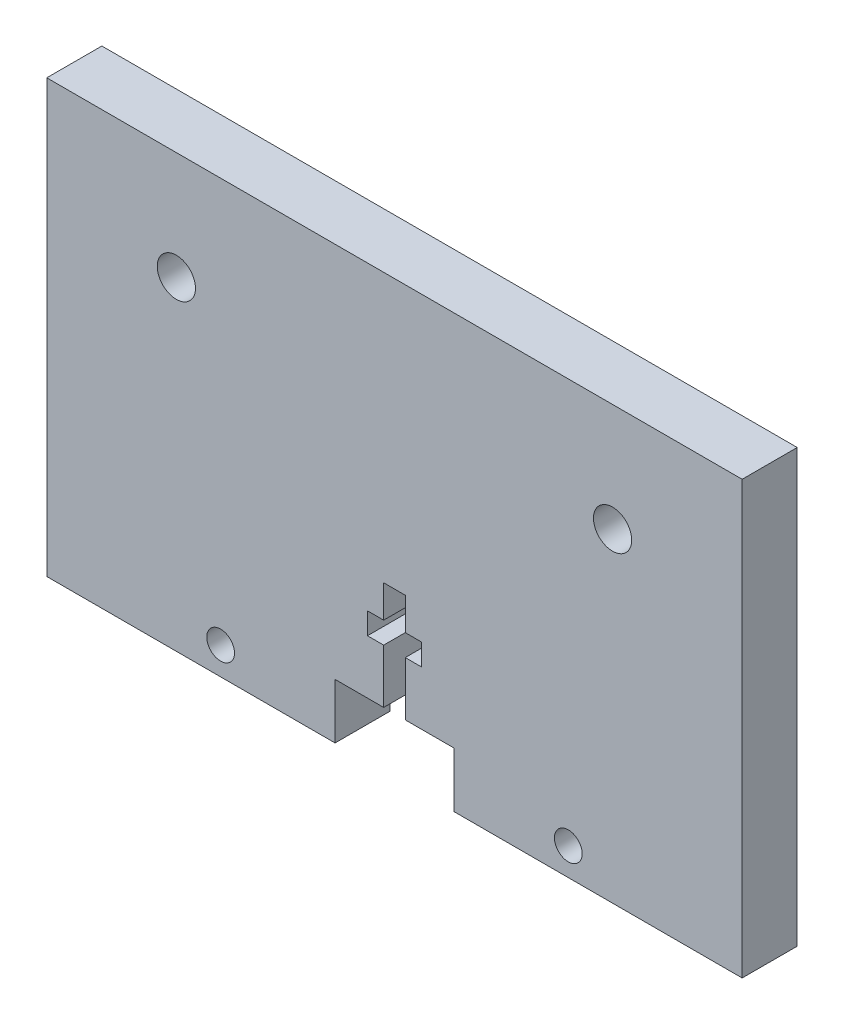
ISO-10303-21;
HEADER;
FILE_DESCRIPTION(('STEP AP214'),'2;1');
FILE_NAME('part.step','',(''),(''),'','','');
FILE_SCHEMA(('AUTOMOTIVE_DESIGN { 1 0 10303 214 1 1 1 1 }'));
ENDSEC;
DATA;
#1=APPLICATION_CONTEXT('core data for automotive mechanical design processes');
#2=APPLICATION_PROTOCOL_DEFINITION('international standard','automotive_design',2000,#1);
#3=PRODUCT_CONTEXT('',#1,'mechanical');
#4=PRODUCT('Part','Part','',(#3));
#5=PRODUCT_RELATED_PRODUCT_CATEGORY('part','',(#4));
#6=PRODUCT_DEFINITION_FORMATION('','',#4);
#7=PRODUCT_DEFINITION_CONTEXT('part definition',#1,'design');
#8=PRODUCT_DEFINITION('design','',#6,#7);
#9=PRODUCT_DEFINITION_SHAPE('','',#8);
#10=(LENGTH_UNIT() NAMED_UNIT(*) SI_UNIT(.MILLI.,.METRE.));
#11=(NAMED_UNIT(*) PLANE_ANGLE_UNIT() SI_UNIT($,.RADIAN.));
#12=(NAMED_UNIT(*) SI_UNIT($,.STERADIAN.) SOLID_ANGLE_UNIT());
#13=UNCERTAINTY_MEASURE_WITH_UNIT(LENGTH_MEASURE(1.E-05),#10,'distance_accuracy_value','');
#14=(GEOMETRIC_REPRESENTATION_CONTEXT(3) GLOBAL_UNCERTAINTY_ASSIGNED_CONTEXT((#13)) GLOBAL_UNIT_ASSIGNED_CONTEXT((#10,
#11,#12)) REPRESENTATION_CONTEXT('',''));
#15=CARTESIAN_POINT('',(0.,0.,0.));
#16=DIRECTION('',(0.,0.,1.));
#17=DIRECTION('',(1.,0.,0.));
#18=AXIS2_PLACEMENT_3D('',#15,#16,#17);
#19=CARTESIAN_POINT('',(3.175,0.,6.477));
#20=DIRECTION('',(-1.,0.,0.));
#21=DIRECTION('',(0.,-1.,0.));
#22=AXIS2_PLACEMENT_3D('',#19,#20,#21);
#23=PLANE('',#22);
#24=DIRECTION('',(0.,1.,0.));
#25=VECTOR('',#24,1.);
#26=CARTESIAN_POINT('',(3.175,0.,0.));
#27=LINE('',#26,#25);
#28=CARTESIAN_POINT('',(3.175,-12.573,0.));
#29=VERTEX_POINT('',#28);
#30=CARTESIAN_POINT('',(3.175,-10.033,0.));
#31=VERTEX_POINT('',#30);
#32=EDGE_CURVE('E242',#29,#31,#27,.T.);
#33=ORIENTED_EDGE('',*,*,#32,.F.);
#34=DIRECTION('',(0.,0.,-1.));
#35=VECTOR('',#34,1.);
#36=CARTESIAN_POINT('',(3.175,-12.573,6.477));
#37=LINE('',#36,#35);
#38=CARTESIAN_POINT('',(3.175,-12.573,6.477));
#39=VERTEX_POINT('',#38);
#40=EDGE_CURVE('E11',#39,#29,#37,.T.);
#41=ORIENTED_EDGE('',*,*,#40,.F.);
#42=DIRECTION('',(0.,1.,0.));
#43=VECTOR('',#42,1.);
#44=CARTESIAN_POINT('',(3.175,0.,6.477));
#45=LINE('',#44,#43);
#46=CARTESIAN_POINT('',(3.175,-10.033,6.477));
#47=VERTEX_POINT('',#46);
#48=EDGE_CURVE('E211',#39,#47,#45,.T.);
#49=ORIENTED_EDGE('',*,*,#48,.T.);
#50=DIRECTION('',(0.,0.,-1.));
#51=VECTOR('',#50,1.);
#52=CARTESIAN_POINT('',(3.175,-10.033,6.477));
#53=LINE('',#52,#51);
#54=EDGE_CURVE('E121',#47,#31,#53,.T.);
#55=ORIENTED_EDGE('',*,*,#54,.T.);
#56=EDGE_LOOP('',(#33,#41,#49,#55));
#57=FACE_BOUND('',#56,.T.);
#58=ADVANCED_FACE('F34',(#57),#23,.T.);
#59=CARTESIAN_POINT('',(0.,-12.573,6.477));
#60=DIRECTION('',(0.,1.,0.));
#61=DIRECTION('',(0.,0.,1.));
#62=AXIS2_PLACEMENT_3D('',#59,#60,#61);
#63=PLANE('',#62);
#64=DIRECTION('',(1.,0.,0.));
#65=VECTOR('',#64,1.);
#66=CARTESIAN_POINT('',(0.,-12.573,0.));
#67=LINE('',#66,#65);
#68=CARTESIAN_POINT('',(1.27,-12.573,0.));
#69=VERTEX_POINT('',#68);
#70=EDGE_CURVE('E245',#69,#29,#67,.T.);
#71=ORIENTED_EDGE('',*,*,#70,.F.);
#72=DIRECTION('',(0.,0.,-1.));
#73=VECTOR('',#72,1.);
#74=CARTESIAN_POINT('',(1.27,-12.573,6.477));
#75=LINE('',#74,#73);
#76=CARTESIAN_POINT('',(1.27,-12.573,6.477));
#77=VERTEX_POINT('',#76);
#78=EDGE_CURVE('E43',#77,#69,#75,.T.);
#79=ORIENTED_EDGE('',*,*,#78,.F.);
#80=DIRECTION('',(1.,0.,0.));
#81=VECTOR('',#80,1.);
#82=CARTESIAN_POINT('',(0.,-12.573,6.477));
#83=LINE('',#82,#81);
#84=EDGE_CURVE('E205',#77,#39,#83,.T.);
#85=ORIENTED_EDGE('',*,*,#84,.T.);
#86=ORIENTED_EDGE('',*,*,#40,.T.);
#87=EDGE_LOOP('',(#71,#79,#85,#86));
#88=FACE_BOUND('',#87,.T.);
#89=ADVANCED_FACE('F334',(#88),#63,.T.);
#90=CARTESIAN_POINT('',(1.27,0.,6.477));
#91=DIRECTION('',(-1.,0.,0.));
#92=DIRECTION('',(0.,-1.,0.));
#93=AXIS2_PLACEMENT_3D('',#90,#91,#92);
#94=PLANE('',#93);
#95=DIRECTION('',(0.,1.,0.));
#96=VECTOR('',#95,1.);
#97=CARTESIAN_POINT('',(1.27,0.,0.));
#98=LINE('',#97,#96);
#99=CARTESIAN_POINT('',(1.27,-18.923,0.));
#100=VERTEX_POINT('',#99);
#101=EDGE_CURVE('E248',#100,#69,#98,.T.);
#102=ORIENTED_EDGE('',*,*,#101,.F.);
#103=DIRECTION('',(0.,0.,-1.));
#104=VECTOR('',#103,1.);
#105=CARTESIAN_POINT('',(1.27,-18.923,6.477));
#106=LINE('',#105,#104);
#107=CARTESIAN_POINT('',(1.27,-18.923,6.477));
#108=VERTEX_POINT('',#107);
#109=EDGE_CURVE('E330',#108,#100,#106,.T.);
#110=ORIENTED_EDGE('',*,*,#109,.F.);
#111=DIRECTION('',(0.,1.,0.));
#112=VECTOR('',#111,1.);
#113=CARTESIAN_POINT('',(1.27,0.,6.477));
#114=LINE('',#113,#112);
#115=EDGE_CURVE('E197',#108,#77,#114,.T.);
#116=ORIENTED_EDGE('',*,*,#115,.T.);
#117=ORIENTED_EDGE('',*,*,#78,.T.);
#118=EDGE_LOOP('',(#102,#110,#116,#117));
#119=FACE_BOUND('',#118,.T.);
#120=ADVANCED_FACE('F333',(#119),#94,.T.);
#121=CARTESIAN_POINT('',(0.,-18.923,6.477));
#122=DIRECTION('',(0.,1.,0.));
#123=DIRECTION('',(0.,0.,1.));
#124=AXIS2_PLACEMENT_3D('',#121,#122,#123);
#125=PLANE('',#124);
#126=DIRECTION('',(1.,0.,0.));
#127=VECTOR('',#126,1.);
#128=CARTESIAN_POINT('',(0.,-18.923,0.));
#129=LINE('',#128,#127);
#130=CARTESIAN_POINT('',(6.985,-18.923,0.));
#131=VERTEX_POINT('',#130);
#132=EDGE_CURVE('E252',#100,#131,#129,.T.);
#133=ORIENTED_EDGE('',*,*,#132,.T.);
#134=DIRECTION('',(0.,0.,-1.));
#135=VECTOR('',#134,1.);
#136=CARTESIAN_POINT('',(6.985,-18.923,6.477));
#137=LINE('',#136,#135);
#138=CARTESIAN_POINT('',(6.985,-18.923,6.477));
#139=VERTEX_POINT('',#138);
#140=EDGE_CURVE('E328',#139,#131,#137,.T.);
#141=ORIENTED_EDGE('',*,*,#140,.F.);
#142=DIRECTION('',(1.,0.,0.));
#143=VECTOR('',#142,1.);
#144=CARTESIAN_POINT('',(0.,-18.923,6.477));
#145=LINE('',#144,#143);
#146=EDGE_CURVE('E204',#108,#139,#145,.T.);
#147=ORIENTED_EDGE('',*,*,#146,.F.);
#148=ORIENTED_EDGE('',*,*,#109,.T.);
#149=EDGE_LOOP('',(#133,#141,#147,#148));
#150=FACE_BOUND('',#149,.T.);
#151=ADVANCED_FACE('F343',(#150),#125,.F.);
#152=CARTESIAN_POINT('',(6.985,0.,6.477));
#153=DIRECTION('',(-1.,0.,0.));
#154=DIRECTION('',(0.,0.,1.));
#155=AXIS2_PLACEMENT_3D('',#152,#153,#154);
#156=PLANE('',#155);
#157=DIRECTION('',(0.,1.,0.));
#158=VECTOR('',#157,1.);
#159=CARTESIAN_POINT('',(6.985,0.,0.));
#160=LINE('',#159,#158);
#161=CARTESIAN_POINT('',(6.985,-25.4,0.));
#162=VERTEX_POINT('',#161);
#163=EDGE_CURVE('E256',#162,#131,#160,.T.);
#164=ORIENTED_EDGE('',*,*,#163,.F.);
#165=DIRECTION('',(0.,0.,-1.));
#166=VECTOR('',#165,1.);
#167=CARTESIAN_POINT('',(6.985,-25.4,6.477));
#168=LINE('',#167,#166);
#169=CARTESIAN_POINT('',(6.985,-25.4,6.477));
#170=VERTEX_POINT('',#169);
#171=EDGE_CURVE('E326',#170,#162,#168,.T.);
#172=ORIENTED_EDGE('',*,*,#171,.F.);
#173=DIRECTION('',(0.,1.,0.));
#174=VECTOR('',#173,1.);
#175=CARTESIAN_POINT('',(6.985,0.,6.477));
#176=LINE('',#175,#174);
#177=EDGE_CURVE('E208',#170,#139,#176,.T.);
#178=ORIENTED_EDGE('',*,*,#177,.T.);
#179=ORIENTED_EDGE('',*,*,#140,.T.);
#180=EDGE_LOOP('',(#164,#172,#178,#179));
#181=FACE_BOUND('',#180,.T.);
#182=ADVANCED_FACE('F355',(#181),#156,.T.);
#183=CARTESIAN_POINT('',(0.,-25.4,6.477));
#184=DIRECTION('',(0.,1.,0.));
#185=DIRECTION('',(0.,0.,1.));
#186=AXIS2_PLACEMENT_3D('',#183,#184,#185);
#187=PLANE('',#186);
#188=DIRECTION('',(1.,0.,0.));
#189=VECTOR('',#188,1.);
#190=CARTESIAN_POINT('',(0.,-25.4,0.));
#191=LINE('',#190,#189);
#192=CARTESIAN_POINT('',(40.894,-25.4,0.));
#193=VERTEX_POINT('',#192);
#194=EDGE_CURVE('E260',#162,#193,#191,.T.);
#195=ORIENTED_EDGE('',*,*,#194,.T.);
#196=DIRECTION('',(0.,0.,-1.));
#197=VECTOR('',#196,1.);
#198=CARTESIAN_POINT('',(40.894,-25.4,6.477));
#199=LINE('',#198,#197);
#200=CARTESIAN_POINT('',(40.894,-25.4,6.477));
#201=VERTEX_POINT('',#200);
#202=EDGE_CURVE('E323',#201,#193,#199,.T.);
#203=ORIENTED_EDGE('',*,*,#202,.F.);
#204=DIRECTION('',(1.,0.,0.));
#205=VECTOR('',#204,1.);
#206=CARTESIAN_POINT('',(0.,-25.4,6.477));
#207=LINE('',#206,#205);
#208=EDGE_CURVE('E447',#170,#201,#207,.T.);
#209=ORIENTED_EDGE('',*,*,#208,.F.);
#210=ORIENTED_EDGE('',*,*,#171,.T.);
#211=EDGE_LOOP('',(#195,#203,#209,#210));
#212=FACE_BOUND('',#211,.T.);
#213=ADVANCED_FACE('F418',(#212),#187,.F.);
#214=CARTESIAN_POINT('',(40.894,0.,6.477));
#215=DIRECTION('',(-1.,0.,0.));
#216=DIRECTION('',(0.,0.,1.));
#217=AXIS2_PLACEMENT_3D('',#214,#215,#216);
#218=PLANE('',#217);
#219=DIRECTION('',(0.,1.,0.));
#220=VECTOR('',#219,1.);
#221=CARTESIAN_POINT('',(40.894,0.,0.));
#222=LINE('',#221,#220);
#223=CARTESIAN_POINT('',(40.894,25.4,0.));
#224=VERTEX_POINT('',#223);
#225=EDGE_CURVE('E263',#193,#224,#222,.T.);
#226=ORIENTED_EDGE('',*,*,#225,.T.);
#227=DIRECTION('',(0.,0.,-1.));
#228=VECTOR('',#227,1.);
#229=CARTESIAN_POINT('',(40.894,25.4,6.477));
#230=LINE('',#229,#228);
#231=CARTESIAN_POINT('',(40.894,25.4,6.477));
#232=VERTEX_POINT('',#231);
#233=EDGE_CURVE('E321',#232,#224,#230,.T.);
#234=ORIENTED_EDGE('',*,*,#233,.F.);
#235=DIRECTION('',(0.,1.,0.));
#236=VECTOR('',#235,1.);
#237=CARTESIAN_POINT('',(40.894,0.,6.477));
#238=LINE('',#237,#236);
#239=EDGE_CURVE('E443',#201,#232,#238,.T.);
#240=ORIENTED_EDGE('',*,*,#239,.F.);
#241=ORIENTED_EDGE('',*,*,#202,.T.);
#242=EDGE_LOOP('',(#226,#234,#240,#241));
#243=FACE_BOUND('',#242,.T.);
#244=ADVANCED_FACE('F424',(#243),#218,.F.);
#245=CARTESIAN_POINT('',(0.,25.4,6.477));
#246=DIRECTION('',(0.,1.,0.));
#247=DIRECTION('',(0.,0.,1.));
#248=AXIS2_PLACEMENT_3D('',#245,#246,#247);
#249=PLANE('',#248);
#250=DIRECTION('',(1.,0.,0.));
#251=VECTOR('',#250,1.);
#252=CARTESIAN_POINT('',(0.,25.4,0.));
#253=LINE('',#252,#251);
#254=CARTESIAN_POINT('',(-40.894,25.4,0.));
#255=VERTEX_POINT('',#254);
#256=EDGE_CURVE('E267',#255,#224,#253,.T.);
#257=ORIENTED_EDGE('',*,*,#256,.F.);
#258=DIRECTION('',(0.,0.,-1.));
#259=VECTOR('',#258,1.);
#260=CARTESIAN_POINT('',(-40.894,25.4,6.477));
#261=LINE('',#260,#259);
#262=CARTESIAN_POINT('',(-40.894,25.4,6.477));
#263=VERTEX_POINT('',#262);
#264=EDGE_CURVE('E319',#263,#255,#261,.T.);
#265=ORIENTED_EDGE('',*,*,#264,.F.);
#266=DIRECTION('',(1.,0.,0.));
#267=VECTOR('',#266,1.);
#268=CARTESIAN_POINT('',(0.,25.4,6.477));
#269=LINE('',#268,#267);
#270=EDGE_CURVE('E439',#263,#232,#269,.T.);
#271=ORIENTED_EDGE('',*,*,#270,.T.);
#272=ORIENTED_EDGE('',*,*,#233,.T.);
#273=EDGE_LOOP('',(#257,#265,#271,#272));
#274=FACE_BOUND('',#273,.T.);
#275=ADVANCED_FACE('F421',(#274),#249,.T.);
#276=CARTESIAN_POINT('',(-40.894,0.,6.477));
#277=DIRECTION('',(-1.,0.,0.));
#278=DIRECTION('',(0.,0.,1.));
#279=AXIS2_PLACEMENT_3D('',#276,#277,#278);
#280=PLANE('',#279);
#281=DIRECTION('',(0.,1.,0.));
#282=VECTOR('',#281,1.);
#283=CARTESIAN_POINT('',(-40.894,0.,0.));
#284=LINE('',#283,#282);
#285=CARTESIAN_POINT('',(-40.894,-25.4,0.));
#286=VERTEX_POINT('',#285);
#287=EDGE_CURVE('E270',#286,#255,#284,.T.);
#288=ORIENTED_EDGE('',*,*,#287,.F.);
#289=DIRECTION('',(0.,0.,-1.));
#290=VECTOR('',#289,1.);
#291=CARTESIAN_POINT('',(-40.894,-25.4,6.477));
#292=LINE('',#291,#290);
#293=CARTESIAN_POINT('',(-40.894,-25.4,6.477));
#294=VERTEX_POINT('',#293);
#295=EDGE_CURVE('E317',#294,#286,#292,.T.);
#296=ORIENTED_EDGE('',*,*,#295,.F.);
#297=DIRECTION('',(0.,1.,0.));
#298=VECTOR('',#297,1.);
#299=CARTESIAN_POINT('',(-40.894,0.,6.477));
#300=LINE('',#299,#298);
#301=EDGE_CURVE('E442',#294,#263,#300,.T.);
#302=ORIENTED_EDGE('',*,*,#301,.T.);
#303=ORIENTED_EDGE('',*,*,#264,.T.);
#304=EDGE_LOOP('',(#288,#296,#302,#303));
#305=FACE_BOUND('',#304,.T.);
#306=ADVANCED_FACE('F416',(#305),#280,.T.);
#307=CARTESIAN_POINT('',(-6.985,-25.4,0.));
#308=VERTEX_POINT('',#307);
#309=EDGE_CURVE('E264',#286,#308,#191,.T.);
#310=ORIENTED_EDGE('',*,*,#309,.T.);
#311=DIRECTION('',(0.,0.,-1.));
#312=VECTOR('',#311,1.);
#313=CARTESIAN_POINT('',(-6.985,-25.4,6.477));
#314=LINE('',#313,#312);
#315=CARTESIAN_POINT('',(-6.985,-25.4,6.477));
#316=VERTEX_POINT('',#315);
#317=EDGE_CURVE('E314',#316,#308,#314,.T.);
#318=ORIENTED_EDGE('',*,*,#317,.F.);
#319=EDGE_CURVE('E445',#294,#316,#207,.T.);
#320=ORIENTED_EDGE('',*,*,#319,.F.);
#321=ORIENTED_EDGE('',*,*,#295,.T.);
#322=EDGE_LOOP('',(#310,#318,#320,#321));
#323=FACE_BOUND('',#322,.T.);
#324=ADVANCED_FACE('F412',(#323),#187,.F.);
#325=CARTESIAN_POINT('',(-6.98500000000001,0.,6.477));
#326=DIRECTION('',(-1.,0.,0.));
#327=DIRECTION('',(0.,-1.,0.));
#328=AXIS2_PLACEMENT_3D('',#325,#326,#327);
#329=PLANE('',#328);
#330=DIRECTION('',(0.,1.,0.));
#331=VECTOR('',#330,1.);
#332=CARTESIAN_POINT('',(-6.98500000000001,0.,0.));
#333=LINE('',#332,#331);
#334=CARTESIAN_POINT('',(-6.985,-18.923,0.));
#335=VERTEX_POINT('',#334);
#336=EDGE_CURVE('E273',#308,#335,#333,.T.);
#337=ORIENTED_EDGE('',*,*,#336,.T.);
#338=DIRECTION('',(0.,0.,-1.));
#339=VECTOR('',#338,1.);
#340=CARTESIAN_POINT('',(-6.985,-18.923,6.477));
#341=LINE('',#340,#339);
#342=CARTESIAN_POINT('',(-6.985,-18.923,6.477));
#343=VERTEX_POINT('',#342);
#344=EDGE_CURVE('E311',#343,#335,#341,.T.);
#345=ORIENTED_EDGE('',*,*,#344,.F.);
#346=DIRECTION('',(0.,1.,0.));
#347=VECTOR('',#346,1.);
#348=CARTESIAN_POINT('',(-6.98500000000001,0.,6.477));
#349=LINE('',#348,#347);
#350=EDGE_CURVE('E227',#316,#343,#349,.T.);
#351=ORIENTED_EDGE('',*,*,#350,.F.);
#352=ORIENTED_EDGE('',*,*,#317,.T.);
#353=EDGE_LOOP('',(#337,#345,#351,#352));
#354=FACE_BOUND('',#353,.T.);
#355=ADVANCED_FACE('F408',(#354),#329,.F.);
#356=CARTESIAN_POINT('',(-1.27,-18.923,0.));
#357=VERTEX_POINT('',#356);
#358=EDGE_CURVE('E257',#335,#357,#129,.T.);
#359=ORIENTED_EDGE('',*,*,#358,.T.);
#360=DIRECTION('',(0.,0.,-1.));
#361=VECTOR('',#360,1.);
#362=CARTESIAN_POINT('',(-1.27,-18.923,6.477));
#363=LINE('',#362,#361);
#364=CARTESIAN_POINT('',(-1.27,-18.923,6.477));
#365=VERTEX_POINT('',#364);
#366=EDGE_CURVE('E308',#365,#357,#363,.T.);
#367=ORIENTED_EDGE('',*,*,#366,.F.);
#368=EDGE_CURVE('E209',#343,#365,#145,.T.);
#369=ORIENTED_EDGE('',*,*,#368,.F.);
#370=ORIENTED_EDGE('',*,*,#344,.T.);
#371=EDGE_LOOP('',(#359,#367,#369,#370));
#372=FACE_BOUND('',#371,.T.);
#373=ADVANCED_FACE('F405',(#372),#125,.F.);
#374=CARTESIAN_POINT('',(-1.27,0.,6.477));
#375=DIRECTION('',(-1.,0.,0.));
#376=DIRECTION('',(0.,0.,1.));
#377=AXIS2_PLACEMENT_3D('',#374,#375,#376);
#378=PLANE('',#377);
#379=DIRECTION('',(0.,1.,0.));
#380=VECTOR('',#379,1.);
#381=CARTESIAN_POINT('',(-1.27,0.,0.));
#382=LINE('',#381,#380);
#383=CARTESIAN_POINT('',(-1.27,-12.573,0.));
#384=VERTEX_POINT('',#383);
#385=EDGE_CURVE('E276',#357,#384,#382,.T.);
#386=ORIENTED_EDGE('',*,*,#385,.T.);
#387=DIRECTION('',(0.,0.,-1.));
#388=VECTOR('',#387,1.);
#389=CARTESIAN_POINT('',(-1.27,-12.573,6.477));
#390=LINE('',#389,#388);
#391=CARTESIAN_POINT('',(-1.27,-12.573,6.477));
#392=VERTEX_POINT('',#391);
#393=EDGE_CURVE('E306',#392,#384,#390,.T.);
#394=ORIENTED_EDGE('',*,*,#393,.F.);
#395=DIRECTION('',(0.,1.,0.));
#396=VECTOR('',#395,1.);
#397=CARTESIAN_POINT('',(-1.27,0.,6.477));
#398=LINE('',#397,#396);
#399=EDGE_CURVE('E219',#365,#392,#398,.T.);
#400=ORIENTED_EDGE('',*,*,#399,.F.);
#401=ORIENTED_EDGE('',*,*,#366,.T.);
#402=EDGE_LOOP('',(#386,#394,#400,#401));
#403=FACE_BOUND('',#402,.T.);
#404=ADVANCED_FACE('F399',(#403),#378,.F.);
#405=CARTESIAN_POINT('',(-3.175,-12.573,0.));
#406=VERTEX_POINT('',#405);
#407=EDGE_CURVE('E249',#406,#384,#67,.T.);
#408=ORIENTED_EDGE('',*,*,#407,.F.);
#409=DIRECTION('',(0.,0.,-1.));
#410=VECTOR('',#409,1.);
#411=CARTESIAN_POINT('',(-3.175,-12.573,6.477));
#412=LINE('',#411,#410);
#413=CARTESIAN_POINT('',(-3.175,-12.573,6.477));
#414=VERTEX_POINT('',#413);
#415=EDGE_CURVE('E304',#414,#406,#412,.T.);
#416=ORIENTED_EDGE('',*,*,#415,.F.);
#417=EDGE_CURVE('E212',#414,#392,#83,.T.);
#418=ORIENTED_EDGE('',*,*,#417,.T.);
#419=ORIENTED_EDGE('',*,*,#393,.T.);
#420=EDGE_LOOP('',(#408,#416,#418,#419));
#421=FACE_BOUND('',#420,.T.);
#422=ADVANCED_FACE('F353',(#421),#63,.T.);
#423=CARTESIAN_POINT('',(-3.175,0.,6.477));
#424=DIRECTION('',(-1.,0.,0.));
#425=DIRECTION('',(0.,0.,1.));
#426=AXIS2_PLACEMENT_3D('',#423,#424,#425);
#427=PLANE('',#426);
#428=DIRECTION('',(0.,1.,0.));
#429=VECTOR('',#428,1.);
#430=CARTESIAN_POINT('',(-3.175,0.,0.));
#431=LINE('',#430,#429);
#432=CARTESIAN_POINT('',(-3.175,-10.033,0.));
#433=VERTEX_POINT('',#432);
#434=EDGE_CURVE('E280',#406,#433,#431,.T.);
#435=ORIENTED_EDGE('',*,*,#434,.T.);
#436=DIRECTION('',(0.,0.,-1.));
#437=VECTOR('',#436,1.);
#438=CARTESIAN_POINT('',(-3.175,-10.033,6.477));
#439=LINE('',#438,#437);
#440=CARTESIAN_POINT('',(-3.175,-10.033,6.477));
#441=VERTEX_POINT('',#440);
#442=EDGE_CURVE('E301',#441,#433,#439,.T.);
#443=ORIENTED_EDGE('',*,*,#442,.F.);
#444=DIRECTION('',(0.,1.,0.));
#445=VECTOR('',#444,1.);
#446=CARTESIAN_POINT('',(-3.175,0.,6.477));
#447=LINE('',#446,#445);
#448=EDGE_CURVE('E218',#414,#441,#447,.T.);
#449=ORIENTED_EDGE('',*,*,#448,.F.);
#450=ORIENTED_EDGE('',*,*,#415,.T.);
#451=EDGE_LOOP('',(#435,#443,#449,#450));
#452=FACE_BOUND('',#451,.T.);
#453=ADVANCED_FACE('F400',(#452),#427,.F.);
#454=CARTESIAN_POINT('',(0.,-10.033,6.477));
#455=DIRECTION('',(0.,1.,0.));
#456=DIRECTION('',(0.,0.,1.));
#457=AXIS2_PLACEMENT_3D('',#454,#455,#456);
#458=PLANE('',#457);
#459=DIRECTION('',(1.,0.,0.));
#460=VECTOR('',#459,1.);
#461=CARTESIAN_POINT('',(0.,-10.033,0.));
#462=LINE('',#461,#460);
#463=CARTESIAN_POINT('',(-1.27,-10.033,0.));
#464=VERTEX_POINT('',#463);
#465=EDGE_CURVE('E283',#433,#464,#462,.T.);
#466=ORIENTED_EDGE('',*,*,#465,.T.);
#467=DIRECTION('',(0.,0.,-1.));
#468=VECTOR('',#467,1.);
#469=CARTESIAN_POINT('',(-1.27,-10.033,6.477));
#470=LINE('',#469,#468);
#471=CARTESIAN_POINT('',(-1.27,-10.033,6.477));
#472=VERTEX_POINT('',#471);
#473=EDGE_CURVE('E298',#472,#464,#470,.T.);
#474=ORIENTED_EDGE('',*,*,#473,.F.);
#475=DIRECTION('',(1.,0.,0.));
#476=VECTOR('',#475,1.);
#477=CARTESIAN_POINT('',(0.,-10.033,6.477));
#478=LINE('',#477,#476);
#479=EDGE_CURVE('E200',#441,#472,#478,.T.);
#480=ORIENTED_EDGE('',*,*,#479,.F.);
#481=ORIENTED_EDGE('',*,*,#442,.T.);
#482=EDGE_LOOP('',(#466,#474,#480,#481));
#483=FACE_BOUND('',#482,.T.);
#484=ADVANCED_FACE('F369',(#483),#458,.F.);
#485=CARTESIAN_POINT('',(-1.27,-6.223,0.));
#486=VERTEX_POINT('',#485);
#487=EDGE_CURVE('E279',#464,#486,#382,.T.);
#488=ORIENTED_EDGE('',*,*,#487,.T.);
#489=DIRECTION('',(0.,0.,-1.));
#490=VECTOR('',#489,1.);
#491=CARTESIAN_POINT('',(-1.27,-6.223,6.477));
#492=LINE('',#491,#490);
#493=CARTESIAN_POINT('',(-1.27,-6.223,6.477));
#494=VERTEX_POINT('',#493);
#495=EDGE_CURVE('E193',#494,#486,#492,.T.);
#496=ORIENTED_EDGE('',*,*,#495,.F.);
#497=EDGE_CURVE('E181',#472,#494,#398,.T.);
#498=ORIENTED_EDGE('',*,*,#497,.F.);
#499=ORIENTED_EDGE('',*,*,#473,.T.);
#500=EDGE_LOOP('',(#488,#496,#498,#499));
#501=FACE_BOUND('',#500,.T.);
#502=ADVANCED_FACE('F395',(#501),#378,.F.);
#503=CARTESIAN_POINT('',(0.,-6.223,6.477));
#504=DIRECTION('',(0.,1.,0.));
#505=DIRECTION('',(0.,0.,1.));
#506=AXIS2_PLACEMENT_3D('',#503,#504,#505);
#507=PLANE('',#506);
#508=DIRECTION('',(1.,0.,0.));
#509=VECTOR('',#508,1.);
#510=CARTESIAN_POINT('',(0.,-6.223,0.));
#511=LINE('',#510,#509);
#512=CARTESIAN_POINT('',(1.27,-6.223,0.));
#513=VERTEX_POINT('',#512);
#514=EDGE_CURVE('E189',#486,#513,#511,.T.);
#515=ORIENTED_EDGE('',*,*,#514,.T.);
#516=DIRECTION('',(0.,0.,-1.));
#517=VECTOR('',#516,1.);
#518=CARTESIAN_POINT('',(1.27,-6.223,6.477));
#519=LINE('',#518,#517);
#520=CARTESIAN_POINT('',(1.27,-6.223,6.477));
#521=VERTEX_POINT('',#520);
#522=EDGE_CURVE('E187',#521,#513,#519,.T.);
#523=ORIENTED_EDGE('',*,*,#522,.F.);
#524=DIRECTION('',(1.,0.,0.));
#525=VECTOR('',#524,1.);
#526=CARTESIAN_POINT('',(0.,-6.223,6.477));
#527=LINE('',#526,#525);
#528=EDGE_CURVE('E174',#494,#521,#527,.T.);
#529=ORIENTED_EDGE('',*,*,#528,.F.);
#530=ORIENTED_EDGE('',*,*,#495,.T.);
#531=EDGE_LOOP('',(#515,#523,#529,#530));
#532=FACE_BOUND('',#531,.T.);
#533=ADVANCED_FACE('F188',(#532),#507,.F.);
#534=CARTESIAN_POINT('',(1.27,-10.033,0.));
#535=VERTEX_POINT('',#534);
#536=EDGE_CURVE('E253',#535,#513,#98,.T.);
#537=ORIENTED_EDGE('',*,*,#536,.F.);
#538=DIRECTION('',(0.,0.,-1.));
#539=VECTOR('',#538,1.);
#540=CARTESIAN_POINT('',(1.27,-10.033,6.477));
#541=LINE('',#540,#539);
#542=CARTESIAN_POINT('',(1.27,-10.033,6.477));
#543=VERTEX_POINT('',#542);
#544=EDGE_CURVE('E114',#543,#535,#541,.T.);
#545=ORIENTED_EDGE('',*,*,#544,.F.);
#546=EDGE_CURVE('E179',#543,#521,#114,.T.);
#547=ORIENTED_EDGE('',*,*,#546,.T.);
#548=ORIENTED_EDGE('',*,*,#522,.T.);
#549=EDGE_LOOP('',(#537,#545,#547,#548));
#550=FACE_BOUND('',#549,.T.);
#551=ADVANCED_FACE('F195',(#550),#94,.T.);
#552=CARTESIAN_POINT('',(-20.447,-22.1615,6.477));
#553=DIRECTION('',(0.,0.,-1.));
#554=DIRECTION('',(-1.,0.,0.));
#555=AXIS2_PLACEMENT_3D('',#552,#553,#554);
#556=CYLINDRICAL_SURFACE('',#555,1.63195);
#557=CARTESIAN_POINT('',(-20.447,-22.1615,6.477));
#558=DIRECTION('',(0.,0.,1.));
#559=DIRECTION('',(1.,0.,0.));
#560=AXIS2_PLACEMENT_3D('',#557,#558,#559);
#561=CIRCLE('',#560,1.63195);
#562=CARTESIAN_POINT('',(-18.81505,-22.1615,6.477));
#563=VERTEX_POINT('',#562);
#564=EDGE_CURVE('E198',#563,#563,#561,.T.);
#565=ORIENTED_EDGE('',*,*,#564,.T.);
#566=EDGE_LOOP('',(#565));
#567=FACE_BOUND('',#566,.T.);
#568=CARTESIAN_POINT('',(-20.447,-22.1615,0.));
#569=DIRECTION('',(0.,0.,1.));
#570=DIRECTION('',(1.,0.,0.));
#571=AXIS2_PLACEMENT_3D('',#568,#569,#570);
#572=CIRCLE('',#571,1.63195);
#573=CARTESIAN_POINT('',(-18.81505,-22.1615,0.));
#574=VERTEX_POINT('',#573);
#575=EDGE_CURVE('E288',#574,#574,#572,.T.);
#576=ORIENTED_EDGE('',*,*,#575,.F.);
#577=EDGE_LOOP('',(#576));
#578=FACE_BOUND('',#577,.T.);
#579=ADVANCED_FACE('F367',(#567,#578),#556,.F.);
#580=EDGE_CURVE('E286',#535,#31,#462,.T.);
#581=ORIENTED_EDGE('',*,*,#580,.T.);
#582=ORIENTED_EDGE('',*,*,#54,.F.);
#583=EDGE_CURVE('E51',#543,#47,#478,.T.);
#584=ORIENTED_EDGE('',*,*,#583,.F.);
#585=ORIENTED_EDGE('',*,*,#544,.T.);
#586=EDGE_LOOP('',(#581,#582,#584,#585));
#587=FACE_BOUND('',#586,.T.);
#588=ADVANCED_FACE('F359',(#587),#458,.F.);
#589=CARTESIAN_POINT('',(-25.654,12.7,6.477));
#590=DIRECTION('',(0.,0.,-1.));
#591=DIRECTION('',(-1.,0.,0.));
#592=AXIS2_PLACEMENT_3D('',#589,#590,#591);
#593=CYLINDRICAL_SURFACE('',#592,2.2479);
#594=CARTESIAN_POINT('',(-25.654,12.7,6.477));
#595=DIRECTION('',(0.,0.,1.));
#596=DIRECTION('',(1.,0.,0.));
#597=AXIS2_PLACEMENT_3D('',#594,#595,#596);
#598=CIRCLE('',#597,2.2479);
#599=CARTESIAN_POINT('',(-23.4061,12.7,6.477));
#600=VERTEX_POINT('',#599);
#601=EDGE_CURVE('E215',#600,#600,#598,.T.);
#602=ORIENTED_EDGE('',*,*,#601,.T.);
#603=EDGE_LOOP('',(#602));
#604=FACE_BOUND('',#603,.T.);
#605=CARTESIAN_POINT('',(-25.654,12.7,0.));
#606=DIRECTION('',(0.,0.,1.));
#607=DIRECTION('',(1.,0.,0.));
#608=AXIS2_PLACEMENT_3D('',#605,#606,#607);
#609=CIRCLE('',#608,2.2479);
#610=CARTESIAN_POINT('',(-23.4061,12.7,0.));
#611=VERTEX_POINT('',#610);
#612=EDGE_CURVE('E239',#611,#611,#609,.T.);
#613=ORIENTED_EDGE('',*,*,#612,.F.);
#614=EDGE_LOOP('',(#613));
#615=FACE_BOUND('',#614,.T.);
#616=ADVANCED_FACE('F357',(#604,#615),#593,.F.);
#617=CARTESIAN_POINT('',(25.654,12.7,6.477));
#618=DIRECTION('',(0.,0.,-1.));
#619=DIRECTION('',(-1.,0.,0.));
#620=AXIS2_PLACEMENT_3D('',#617,#618,#619);
#621=CYLINDRICAL_SURFACE('',#620,2.2479);
#622=CARTESIAN_POINT('',(25.654,12.7,6.477));
#623=DIRECTION('',(0.,0.,1.));
#624=DIRECTION('',(1.,0.,0.));
#625=AXIS2_PLACEMENT_3D('',#622,#623,#624);
#626=CIRCLE('',#625,2.2479);
#627=CARTESIAN_POINT('',(27.9019,12.7,6.477));
#628=VERTEX_POINT('',#627);
#629=EDGE_CURVE('E294',#628,#628,#626,.F.);
#630=ORIENTED_EDGE('',*,*,#629,.F.);
#631=EDGE_LOOP('',(#630));
#632=FACE_BOUND('',#631,.T.);
#633=CARTESIAN_POINT('',(25.654,12.7,0.));
#634=DIRECTION('',(0.,0.,1.));
#635=DIRECTION('',(1.,0.,0.));
#636=AXIS2_PLACEMENT_3D('',#633,#634,#635);
#637=CIRCLE('',#636,2.2479);
#638=CARTESIAN_POINT('',(27.9019,12.7,0.));
#639=VERTEX_POINT('',#638);
#640=EDGE_CURVE('E236',#639,#639,#637,.F.);
#641=ORIENTED_EDGE('',*,*,#640,.T.);
#642=EDGE_LOOP('',(#641));
#643=FACE_BOUND('',#642,.T.);
#644=ADVANCED_FACE('F36',(#632,#643),#621,.F.);
#645=CARTESIAN_POINT('',(20.447,-22.1615,6.477));
#646=DIRECTION('',(0.,0.,-1.));
#647=DIRECTION('',(-1.,0.,0.));
#648=AXIS2_PLACEMENT_3D('',#645,#646,#647);
#649=CYLINDRICAL_SURFACE('',#648,1.63195);
#650=CARTESIAN_POINT('',(20.447,-22.1615,6.477));
#651=DIRECTION('',(0.,0.,1.));
#652=DIRECTION('',(1.,0.,0.));
#653=AXIS2_PLACEMENT_3D('',#650,#651,#652);
#654=CIRCLE('',#653,1.63195);
#655=CARTESIAN_POINT('',(22.07895,-22.1615,6.477));
#656=VERTEX_POINT('',#655);
#657=EDGE_CURVE('E233',#656,#656,#654,.F.);
#658=ORIENTED_EDGE('',*,*,#657,.F.);
#659=EDGE_LOOP('',(#658));
#660=FACE_BOUND('',#659,.T.);
#661=CARTESIAN_POINT('',(20.447,-22.1615,0.));
#662=DIRECTION('',(0.,0.,1.));
#663=DIRECTION('',(1.,0.,0.));
#664=AXIS2_PLACEMENT_3D('',#661,#662,#663);
#665=CIRCLE('',#664,1.63195);
#666=CARTESIAN_POINT('',(22.07895,-22.1615,0.));
#667=VERTEX_POINT('',#666);
#668=EDGE_CURVE('E291',#667,#667,#665,.F.);
#669=ORIENTED_EDGE('',*,*,#668,.T.);
#670=EDGE_LOOP('',(#669));
#671=FACE_BOUND('',#670,.T.);
#672=ADVANCED_FACE('F365',(#660,#671),#649,.F.);
#673=CARTESIAN_POINT('',(0.,0.,6.477));
#674=DIRECTION('',(0.,0.,1.));
#675=DIRECTION('',(1.,0.,0.));
#676=AXIS2_PLACEMENT_3D('',#673,#674,#675);
#677=PLANE('',#676);
#678=ORIENTED_EDGE('',*,*,#629,.T.);
#679=EDGE_LOOP('',(#678));
#680=FACE_BOUND('',#679,.T.);
#681=ORIENTED_EDGE('',*,*,#601,.F.);
#682=EDGE_LOOP('',(#681));
#683=FACE_BOUND('',#682,.T.);
#684=ORIENTED_EDGE('',*,*,#48,.F.);
#685=ORIENTED_EDGE('',*,*,#84,.F.);
#686=ORIENTED_EDGE('',*,*,#115,.F.);
#687=ORIENTED_EDGE('',*,*,#146,.T.);
#688=ORIENTED_EDGE('',*,*,#177,.F.);
#689=ORIENTED_EDGE('',*,*,#208,.T.);
#690=ORIENTED_EDGE('',*,*,#239,.T.);
#691=ORIENTED_EDGE('',*,*,#270,.F.);
#692=ORIENTED_EDGE('',*,*,#301,.F.);
#693=ORIENTED_EDGE('',*,*,#319,.T.);
#694=ORIENTED_EDGE('',*,*,#350,.T.);
#695=ORIENTED_EDGE('',*,*,#368,.T.);
#696=ORIENTED_EDGE('',*,*,#399,.T.);
#697=ORIENTED_EDGE('',*,*,#417,.F.);
#698=ORIENTED_EDGE('',*,*,#448,.T.);
#699=ORIENTED_EDGE('',*,*,#479,.T.);
#700=ORIENTED_EDGE('',*,*,#497,.T.);
#701=ORIENTED_EDGE('',*,*,#528,.T.);
#702=ORIENTED_EDGE('',*,*,#546,.F.);
#703=ORIENTED_EDGE('',*,*,#583,.T.);
#704=EDGE_LOOP('',(#684,#685,#686,#687,#688,#689,#690,#691,#692,#693,#694,#695,#696,#697,#698,
#699,#700,#701,#702,#703));
#705=FACE_BOUND('',#704,.T.);
#706=ORIENTED_EDGE('',*,*,#564,.F.);
#707=EDGE_LOOP('',(#706));
#708=FACE_BOUND('',#707,.T.);
#709=ORIENTED_EDGE('',*,*,#657,.T.);
#710=EDGE_LOOP('',(#709));
#711=FACE_BOUND('',#710,.T.);
#712=ADVANCED_FACE('F176',(#680,#683,#705,#708,#711),#677,.T.);
#713=CARTESIAN_POINT('',(0.,0.,0.));
#714=DIRECTION('',(0.,0.,1.));
#715=DIRECTION('',(1.,0.,0.));
#716=AXIS2_PLACEMENT_3D('',#713,#714,#715);
#717=PLANE('',#716);
#718=ORIENTED_EDGE('',*,*,#640,.F.);
#719=EDGE_LOOP('',(#718));
#720=FACE_BOUND('',#719,.T.);
#721=ORIENTED_EDGE('',*,*,#612,.T.);
#722=EDGE_LOOP('',(#721));
#723=FACE_BOUND('',#722,.T.);
#724=ORIENTED_EDGE('',*,*,#32,.T.);
#725=ORIENTED_EDGE('',*,*,#580,.F.);
#726=ORIENTED_EDGE('',*,*,#536,.T.);
#727=ORIENTED_EDGE('',*,*,#514,.F.);
#728=ORIENTED_EDGE('',*,*,#487,.F.);
#729=ORIENTED_EDGE('',*,*,#465,.F.);
#730=ORIENTED_EDGE('',*,*,#434,.F.);
#731=ORIENTED_EDGE('',*,*,#407,.T.);
#732=ORIENTED_EDGE('',*,*,#385,.F.);
#733=ORIENTED_EDGE('',*,*,#358,.F.);
#734=ORIENTED_EDGE('',*,*,#336,.F.);
#735=ORIENTED_EDGE('',*,*,#309,.F.);
#736=ORIENTED_EDGE('',*,*,#287,.T.);
#737=ORIENTED_EDGE('',*,*,#256,.T.);
#738=ORIENTED_EDGE('',*,*,#225,.F.);
#739=ORIENTED_EDGE('',*,*,#194,.F.);
#740=ORIENTED_EDGE('',*,*,#163,.T.);
#741=ORIENTED_EDGE('',*,*,#132,.F.);
#742=ORIENTED_EDGE('',*,*,#101,.T.);
#743=ORIENTED_EDGE('',*,*,#70,.T.);
#744=EDGE_LOOP('',(#724,#725,#726,#727,#728,#729,#730,#731,#732,#733,#734,#735,#736,#737,#738,
#739,#740,#741,#742,#743));
#745=FACE_BOUND('',#744,.T.);
#746=ORIENTED_EDGE('',*,*,#575,.T.);
#747=EDGE_LOOP('',(#746));
#748=FACE_BOUND('',#747,.T.);
#749=ORIENTED_EDGE('',*,*,#668,.F.);
#750=EDGE_LOOP('',(#749));
#751=FACE_BOUND('',#750,.T.);
#752=ADVANCED_FACE('F337',(#720,#723,#745,#748,#751),#717,.F.);
#753=CLOSED_SHELL('',(#58,#89,#120,#151,#182,#213,#244,#275,#306,#324,#355,#373,#404,#422,#453,
#484,#502,#533,#551,#579,#588,#616,#644,#672,#712,#752));
#754=MANIFOLD_SOLID_BREP('B2',#753);
#755=ADVANCED_BREP_SHAPE_REPRESENTATION('',(#18,#754),#14);
#756=SHAPE_DEFINITION_REPRESENTATION(#9,#755);
ENDSEC;
END-ISO-10303-21;
